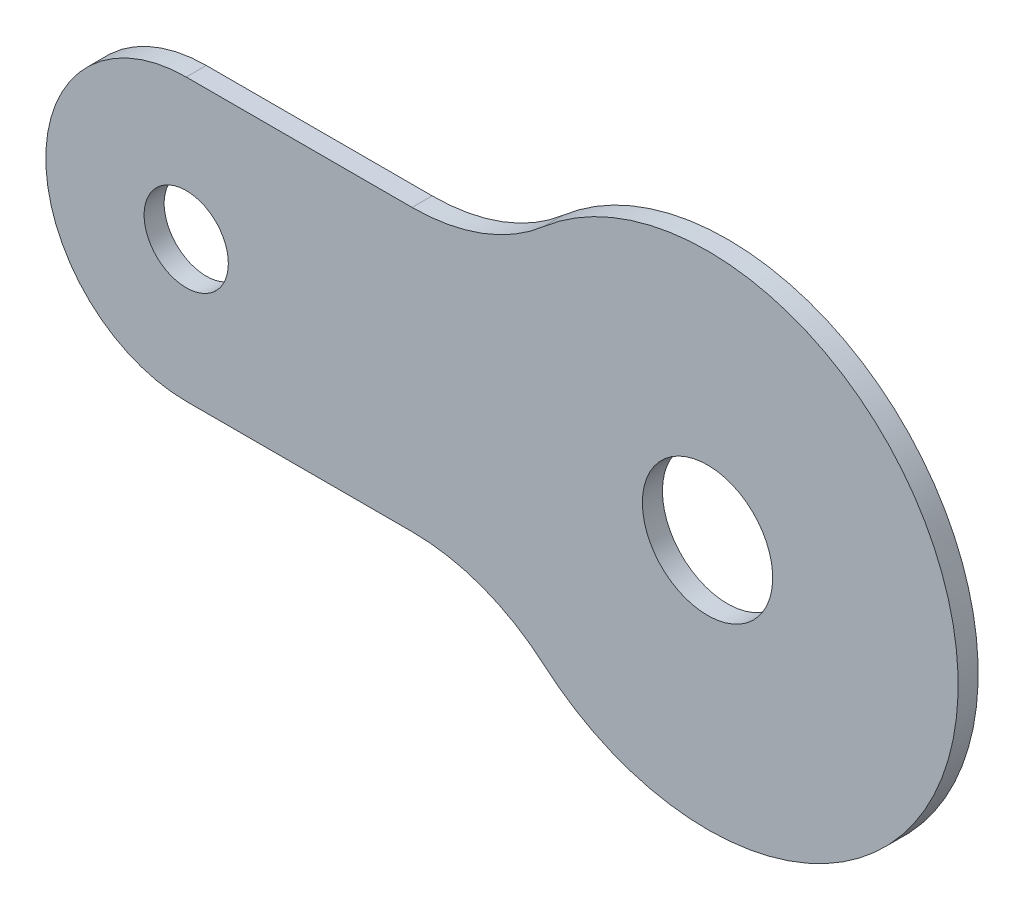
ISO-10303-21;
HEADER;
FILE_DESCRIPTION(('STEP AP214'),'2;1');
FILE_NAME('part.step','',(''),(''),'','','');
FILE_SCHEMA(('AUTOMOTIVE_DESIGN { 1 0 10303 214 1 1 1 1 }'));
ENDSEC;
DATA;
#1=APPLICATION_CONTEXT('core data for automotive mechanical design processes');
#2=APPLICATION_PROTOCOL_DEFINITION('international standard','automotive_design',2000,#1);
#3=PRODUCT_CONTEXT('',#1,'mechanical');
#4=PRODUCT('Part','Part','',(#3));
#5=PRODUCT_RELATED_PRODUCT_CATEGORY('part','',(#4));
#6=PRODUCT_DEFINITION_FORMATION('','',#4);
#7=PRODUCT_DEFINITION_CONTEXT('part definition',#1,'design');
#8=PRODUCT_DEFINITION('design','',#6,#7);
#9=PRODUCT_DEFINITION_SHAPE('','',#8);
#10=(LENGTH_UNIT() NAMED_UNIT(*) SI_UNIT(.MILLI.,.METRE.));
#11=(NAMED_UNIT(*) PLANE_ANGLE_UNIT() SI_UNIT($,.RADIAN.));
#12=(NAMED_UNIT(*) SI_UNIT($,.STERADIAN.) SOLID_ANGLE_UNIT());
#13=UNCERTAINTY_MEASURE_WITH_UNIT(LENGTH_MEASURE(1.E-05),#10,'distance_accuracy_value','');
#14=(GEOMETRIC_REPRESENTATION_CONTEXT(3) GLOBAL_UNCERTAINTY_ASSIGNED_CONTEXT((#13)) GLOBAL_UNIT_ASSIGNED_CONTEXT((#10,
#11,#12)) REPRESENTATION_CONTEXT('',''));
#15=CARTESIAN_POINT('',(0.,0.,0.));
#16=DIRECTION('',(0.,0.,1.));
#17=DIRECTION('',(1.,0.,0.));
#18=AXIS2_PLACEMENT_3D('',#15,#16,#17);
#19=CARTESIAN_POINT('',(0.,0.,1.));
#20=DIRECTION('',(0.,0.,-1.));
#21=DIRECTION('',(-1.,0.,0.));
#22=AXIS2_PLACEMENT_3D('',#19,#20,#21);
#23=CYLINDRICAL_SURFACE('',#22,12.5);
#24=CARTESIAN_POINT('',(0.,0.,1.));
#25=DIRECTION('',(0.,0.,1.));
#26=DIRECTION('',(1.,0.,0.));
#27=AXIS2_PLACEMENT_3D('',#24,#25,#26);
#28=CIRCLE('',#27,12.5);
#29=CARTESIAN_POINT('',(-8.18610865755893,-9.44656683915584,1.));
#30=VERTEX_POINT('',#29);
#31=CARTESIAN_POINT('',(-8.18610865755893,9.44656683915584,1.));
#32=VERTEX_POINT('',#31);
#33=EDGE_CURVE('E122',#30,#32,#28,.T.);
#34=ORIENTED_EDGE('',*,*,#33,.F.);
#35=DIRECTION('',(0.,0.,-1.));
#36=VECTOR('',#35,1.);
#37=CARTESIAN_POINT('',(-8.18610865755893,-9.44656683915584,1.));
#38=LINE('',#37,#36);
#39=CARTESIAN_POINT('',(-8.18610865755893,-9.44656683915584,0.));
#40=VERTEX_POINT('',#39);
#41=EDGE_CURVE('E131',#30,#40,#38,.T.);
#42=ORIENTED_EDGE('',*,*,#41,.T.);
#43=CARTESIAN_POINT('',(0.,0.,0.));
#44=DIRECTION('',(0.,0.,1.));
#45=DIRECTION('',(1.,0.,0.));
#46=AXIS2_PLACEMENT_3D('',#43,#44,#45);
#47=CIRCLE('',#46,12.5);
#48=CARTESIAN_POINT('',(-8.18610865755893,9.44656683915584,0.));
#49=VERTEX_POINT('',#48);
#50=EDGE_CURVE('E120',#40,#49,#47,.T.);
#51=ORIENTED_EDGE('',*,*,#50,.T.);
#52=DIRECTION('',(0.,0.,-1.));
#53=VECTOR('',#52,1.);
#54=CARTESIAN_POINT('',(-8.18610865755893,9.44656683915584,1.));
#55=LINE('',#54,#53);
#56=EDGE_CURVE('E128',#49,#32,#55,.F.);
#57=ORIENTED_EDGE('',*,*,#56,.T.);
#58=EDGE_LOOP('',(#34,#42,#51,#57));
#59=FACE_BOUND('',#58,.T.);
#60=ADVANCED_FACE('F32',(#59),#23,.T.);
#61=CARTESIAN_POINT('',(0.,0.,1.));
#62=DIRECTION('',(0.,0.,1.));
#63=DIRECTION('',(1.,0.,0.));
#64=AXIS2_PLACEMENT_3D('',#61,#62,#63);
#65=PLANE('',#64);
#66=CARTESIAN_POINT('',(0.,0.,1.));
#67=DIRECTION('',(0.,0.,-1.));
#68=DIRECTION('',(-1.,0.,0.));
#69=AXIS2_PLACEMENT_3D('',#66,#67,#68);
#70=CIRCLE('',#69,3.25);
#71=CARTESIAN_POINT('',(-3.25,0.,1.));
#72=VERTEX_POINT('',#71);
#73=EDGE_CURVE('E182',#72,#72,#70,.T.);
#74=ORIENTED_EDGE('',*,*,#73,.T.);
#75=EDGE_LOOP('',(#74));
#76=FACE_BOUND('',#75,.T.);
#77=CARTESIAN_POINT('',(-26.,0.,1.));
#78=DIRECTION('',(0.,0.,1.));
#79=DIRECTION('',(1.,0.,0.));
#80=AXIS2_PLACEMENT_3D('',#77,#78,#79);
#81=CIRCLE('',#80,2.09999999999999);
#82=CARTESIAN_POINT('',(-23.9,0.,1.));
#83=VERTEX_POINT('',#82);
#84=EDGE_CURVE('E180',#83,#83,#81,.T.);
#85=ORIENTED_EDGE('',*,*,#84,.F.);
#86=EDGE_LOOP('',(#85));
#87=FACE_BOUND('',#86,.T.);
#88=DIRECTION('',(1.,0.,0.));
#89=VECTOR('',#88,1.);
#90=CARTESIAN_POINT('',(-25.9999999999999,-7.00382031048051,1.));
#91=LINE('',#90,#89);
#92=CARTESIAN_POINT('',(-25.9999999999999,-7.00382031048051,1.));
#93=VERTEX_POINT('',#92);
#94=CARTESIAN_POINT('',(-14.7349955836061,-7.00382031048051,1.));
#95=VERTEX_POINT('',#94);
#96=EDGE_CURVE('E90',#93,#95,#91,.T.);
#97=ORIENTED_EDGE('',*,*,#96,.T.);
#98=CARTESIAN_POINT('',(-14.7349955836061,-17.0038203104805,1.));
#99=DIRECTION('',(0.,0.,1.));
#100=DIRECTION('',(1.,0.,0.));
#101=AXIS2_PLACEMENT_3D('',#98,#99,#100);
#102=CIRCLE('',#101,10.);
#103=EDGE_CURVE('E134',#95,#30,#102,.F.);
#104=ORIENTED_EDGE('',*,*,#103,.T.);
#105=ORIENTED_EDGE('',*,*,#33,.T.);
#106=CARTESIAN_POINT('',(-14.7349955836061,17.0038203104805,1.));
#107=DIRECTION('',(0.,0.,1.));
#108=DIRECTION('',(1.,0.,0.));
#109=AXIS2_PLACEMENT_3D('',#106,#107,#108);
#110=CIRCLE('',#109,10.);
#111=CARTESIAN_POINT('',(-14.7349955836061,7.00382031048051,1.));
#112=VERTEX_POINT('',#111);
#113=EDGE_CURVE('E40',#32,#112,#110,.F.);
#114=ORIENTED_EDGE('',*,*,#113,.T.);
#115=DIRECTION('',(-1.,0.,0.));
#116=VECTOR('',#115,1.);
#117=CARTESIAN_POINT('',(-26.,7.00382031048051,1.));
#118=LINE('',#117,#116);
#119=CARTESIAN_POINT('',(-26.,7.00382031048051,1.));
#120=VERTEX_POINT('',#119);
#121=EDGE_CURVE('E109',#112,#120,#118,.T.);
#122=ORIENTED_EDGE('',*,*,#121,.T.);
#123=CARTESIAN_POINT('',(-26.,0.,1.));
#124=DIRECTION('',(0.,0.,1.));
#125=DIRECTION('',(1.,0.,0.));
#126=AXIS2_PLACEMENT_3D('',#123,#124,#125);
#127=CIRCLE('',#126,7.00382031048051);
#128=EDGE_CURVE('E117',#120,#93,#127,.T.);
#129=ORIENTED_EDGE('',*,*,#128,.T.);
#130=EDGE_LOOP('',(#97,#104,#105,#114,#122,#129));
#131=FACE_BOUND('',#130,.T.);
#132=ADVANCED_FACE('F137',(#76,#87,#131),#65,.T.);
#133=CARTESIAN_POINT('',(0.,0.,0.));
#134=DIRECTION('',(0.,0.,1.));
#135=DIRECTION('',(1.,0.,0.));
#136=AXIS2_PLACEMENT_3D('',#133,#134,#135);
#137=PLANE('',#136);
#138=CARTESIAN_POINT('',(0.,0.,0.));
#139=DIRECTION('',(0.,0.,-1.));
#140=DIRECTION('',(-1.,0.,0.));
#141=AXIS2_PLACEMENT_3D('',#138,#139,#140);
#142=CIRCLE('',#141,3.25);
#143=CARTESIAN_POINT('',(-3.25,0.,0.));
#144=VERTEX_POINT('',#143);
#145=EDGE_CURVE('E184',#144,#144,#142,.T.);
#146=ORIENTED_EDGE('',*,*,#145,.F.);
#147=EDGE_LOOP('',(#146));
#148=FACE_BOUND('',#147,.T.);
#149=CARTESIAN_POINT('',(-26.,0.,0.));
#150=DIRECTION('',(0.,0.,1.));
#151=DIRECTION('',(1.,0.,0.));
#152=AXIS2_PLACEMENT_3D('',#149,#150,#151);
#153=CIRCLE('',#152,2.1);
#154=CARTESIAN_POINT('',(-23.9,0.,0.));
#155=VERTEX_POINT('',#154);
#156=EDGE_CURVE('E113',#155,#155,#153,.T.);
#157=ORIENTED_EDGE('',*,*,#156,.T.);
#158=EDGE_LOOP('',(#157));
#159=FACE_BOUND('',#158,.T.);
#160=ORIENTED_EDGE('',*,*,#50,.F.);
#161=CARTESIAN_POINT('',(-14.7349955836061,-17.0038203104805,0.));
#162=DIRECTION('',(0.,0.,1.));
#163=DIRECTION('',(1.,0.,0.));
#164=AXIS2_PLACEMENT_3D('',#161,#162,#163);
#165=CIRCLE('',#164,10.);
#166=CARTESIAN_POINT('',(-14.7349955836061,-7.00382031048051,0.));
#167=VERTEX_POINT('',#166);
#168=EDGE_CURVE('E104',#40,#167,#165,.T.);
#169=ORIENTED_EDGE('',*,*,#168,.T.);
#170=DIRECTION('',(1.,0.,0.));
#171=VECTOR('',#170,1.);
#172=CARTESIAN_POINT('',(-25.9999999999999,-7.00382031048051,0.));
#173=LINE('',#172,#171);
#174=CARTESIAN_POINT('',(-25.9999999999999,-7.00382031048051,0.));
#175=VERTEX_POINT('',#174);
#176=EDGE_CURVE('E87',#175,#167,#173,.T.);
#177=ORIENTED_EDGE('',*,*,#176,.F.);
#178=CARTESIAN_POINT('',(-26.,0.,0.));
#179=DIRECTION('',(0.,0.,1.));
#180=DIRECTION('',(1.,0.,0.));
#181=AXIS2_PLACEMENT_3D('',#178,#179,#180);
#182=CIRCLE('',#181,7.00382031048051);
#183=CARTESIAN_POINT('',(-26.,7.00382031048051,0.));
#184=VERTEX_POINT('',#183);
#185=EDGE_CURVE('E102',#184,#175,#182,.T.);
#186=ORIENTED_EDGE('',*,*,#185,.F.);
#187=DIRECTION('',(-1.,0.,0.));
#188=VECTOR('',#187,1.);
#189=CARTESIAN_POINT('',(-26.,7.00382031048051,0.));
#190=LINE('',#189,#188);
#191=CARTESIAN_POINT('',(-14.7349955836061,7.00382031048051,0.));
#192=VERTEX_POINT('',#191);
#193=EDGE_CURVE('E96',#192,#184,#190,.T.);
#194=ORIENTED_EDGE('',*,*,#193,.F.);
#195=CARTESIAN_POINT('',(-14.7349955836061,17.0038203104805,0.));
#196=DIRECTION('',(0.,0.,1.));
#197=DIRECTION('',(1.,0.,0.));
#198=AXIS2_PLACEMENT_3D('',#195,#196,#197);
#199=CIRCLE('',#198,10.);
#200=EDGE_CURVE('E11',#192,#49,#199,.T.);
#201=ORIENTED_EDGE('',*,*,#200,.T.);
#202=EDGE_LOOP('',(#160,#169,#177,#186,#194,#201));
#203=FACE_BOUND('',#202,.T.);
#204=ADVANCED_FACE('F101',(#148,#159,#203),#137,.F.);
#205=CARTESIAN_POINT('',(-26.,0.,0.));
#206=DIRECTION('',(0.,0.,1.));
#207=DIRECTION('',(1.,0.,0.));
#208=AXIS2_PLACEMENT_3D('',#205,#206,#207);
#209=CYLINDRICAL_SURFACE('',#208,7.00382031048051);
#210=ORIENTED_EDGE('',*,*,#128,.F.);
#211=DIRECTION('',(0.,0.,1.));
#212=VECTOR('',#211,1.);
#213=CARTESIAN_POINT('',(-26.,7.00382031048051,0.));
#214=LINE('',#213,#212);
#215=EDGE_CURVE('E95',#184,#120,#214,.T.);
#216=ORIENTED_EDGE('',*,*,#215,.F.);
#217=ORIENTED_EDGE('',*,*,#185,.T.);
#218=DIRECTION('',(0.,0.,1.));
#219=VECTOR('',#218,1.);
#220=CARTESIAN_POINT('',(-25.9999999999999,-7.00382031048051,0.));
#221=LINE('',#220,#219);
#222=EDGE_CURVE('E83',#175,#93,#221,.T.);
#223=ORIENTED_EDGE('',*,*,#222,.T.);
#224=EDGE_LOOP('',(#210,#216,#217,#223));
#225=FACE_BOUND('',#224,.T.);
#226=ADVANCED_FACE('F107',(#225),#209,.T.);
#227=CARTESIAN_POINT('',(-26.,7.00382031048051,0.));
#228=DIRECTION('',(0.,1.,0.));
#229=DIRECTION('',(0.,0.,1.));
#230=AXIS2_PLACEMENT_3D('',#227,#228,#229);
#231=PLANE('',#230);
#232=ORIENTED_EDGE('',*,*,#121,.F.);
#233=DIRECTION('',(0.,0.,-1.));
#234=VECTOR('',#233,1.);
#235=CARTESIAN_POINT('',(-14.7349955836061,7.00382031048051,0.));
#236=LINE('',#235,#234);
#237=EDGE_CURVE('E47',#112,#192,#236,.T.);
#238=ORIENTED_EDGE('',*,*,#237,.T.);
#239=ORIENTED_EDGE('',*,*,#193,.T.);
#240=ORIENTED_EDGE('',*,*,#215,.T.);
#241=EDGE_LOOP('',(#232,#238,#239,#240));
#242=FACE_BOUND('',#241,.T.);
#243=ADVANCED_FACE('F166',(#242),#231,.T.);
#244=CARTESIAN_POINT('',(-25.9999999999999,-7.00382031048051,0.));
#245=DIRECTION('',(0.,-1.,0.));
#246=DIRECTION('',(0.,0.,-1.));
#247=AXIS2_PLACEMENT_3D('',#244,#245,#246);
#248=PLANE('',#247);
#249=ORIENTED_EDGE('',*,*,#176,.T.);
#250=DIRECTION('',(0.,0.,-1.));
#251=VECTOR('',#250,1.);
#252=CARTESIAN_POINT('',(-14.7349955836061,-7.00382031048051,0.));
#253=LINE('',#252,#251);
#254=EDGE_CURVE('E124',#167,#95,#253,.F.);
#255=ORIENTED_EDGE('',*,*,#254,.T.);
#256=ORIENTED_EDGE('',*,*,#96,.F.);
#257=ORIENTED_EDGE('',*,*,#222,.F.);
#258=EDGE_LOOP('',(#249,#255,#256,#257));
#259=FACE_BOUND('',#258,.T.);
#260=ADVANCED_FACE('F85',(#259),#248,.T.);
#261=CARTESIAN_POINT('',(-26.,0.,1.));
#262=DIRECTION('',(0.,0.,1.));
#263=DIRECTION('',(1.,0.,0.));
#264=AXIS2_PLACEMENT_3D('',#261,#262,#263);
#265=CYLINDRICAL_SURFACE('',#264,2.09999999999999);
#266=ORIENTED_EDGE('',*,*,#156,.F.);
#267=EDGE_LOOP('',(#266));
#268=FACE_BOUND('',#267,.T.);
#269=ORIENTED_EDGE('',*,*,#84,.T.);
#270=EDGE_LOOP('',(#269));
#271=FACE_BOUND('',#270,.T.);
#272=ADVANCED_FACE('F150',(#268,#271),#265,.F.);
#273=CARTESIAN_POINT('',(0.,0.,1.));
#274=DIRECTION('',(0.,0.,-1.));
#275=DIRECTION('',(-1.,0.,0.));
#276=AXIS2_PLACEMENT_3D('',#273,#274,#275);
#277=CYLINDRICAL_SURFACE('',#276,3.25);
#278=ORIENTED_EDGE('',*,*,#73,.F.);
#279=EDGE_LOOP('',(#278));
#280=FACE_BOUND('',#279,.T.);
#281=ORIENTED_EDGE('',*,*,#145,.T.);
#282=EDGE_LOOP('',(#281));
#283=FACE_BOUND('',#282,.T.);
#284=ADVANCED_FACE('F144',(#280,#283),#277,.F.);
#285=CARTESIAN_POINT('',(-14.7349955836061,-17.0038203104805,1.));
#286=DIRECTION('',(0.,0.,-1.));
#287=DIRECTION('',(-1.,0.,0.));
#288=AXIS2_PLACEMENT_3D('',#285,#286,#287);
#289=CYLINDRICAL_SURFACE('',#288,10.);
#290=ORIENTED_EDGE('',*,*,#168,.F.);
#291=ORIENTED_EDGE('',*,*,#41,.F.);
#292=ORIENTED_EDGE('',*,*,#103,.F.);
#293=ORIENTED_EDGE('',*,*,#254,.F.);
#294=EDGE_LOOP('',(#290,#291,#292,#293));
#295=FACE_BOUND('',#294,.T.);
#296=ADVANCED_FACE('F142',(#295),#289,.F.);
#297=CARTESIAN_POINT('',(-14.7349955836061,17.0038203104805,1.));
#298=DIRECTION('',(0.,0.,-1.));
#299=DIRECTION('',(-1.,0.,0.));
#300=AXIS2_PLACEMENT_3D('',#297,#298,#299);
#301=CYLINDRICAL_SURFACE('',#300,10.);
#302=ORIENTED_EDGE('',*,*,#200,.F.);
#303=ORIENTED_EDGE('',*,*,#237,.F.);
#304=ORIENTED_EDGE('',*,*,#113,.F.);
#305=ORIENTED_EDGE('',*,*,#56,.F.);
#306=EDGE_LOOP('',(#302,#303,#304,#305));
#307=FACE_BOUND('',#306,.T.);
#308=ADVANCED_FACE('F34',(#307),#301,.F.);
#309=CLOSED_SHELL('',(#60,#132,#204,#226,#243,#260,#272,#284,#296,#308));
#310=MANIFOLD_SOLID_BREP('B2',#309);
#311=ADVANCED_BREP_SHAPE_REPRESENTATION('',(#18,#310),#14);
#312=SHAPE_DEFINITION_REPRESENTATION(#9,#311);
ENDSEC;
END-ISO-10303-21;
